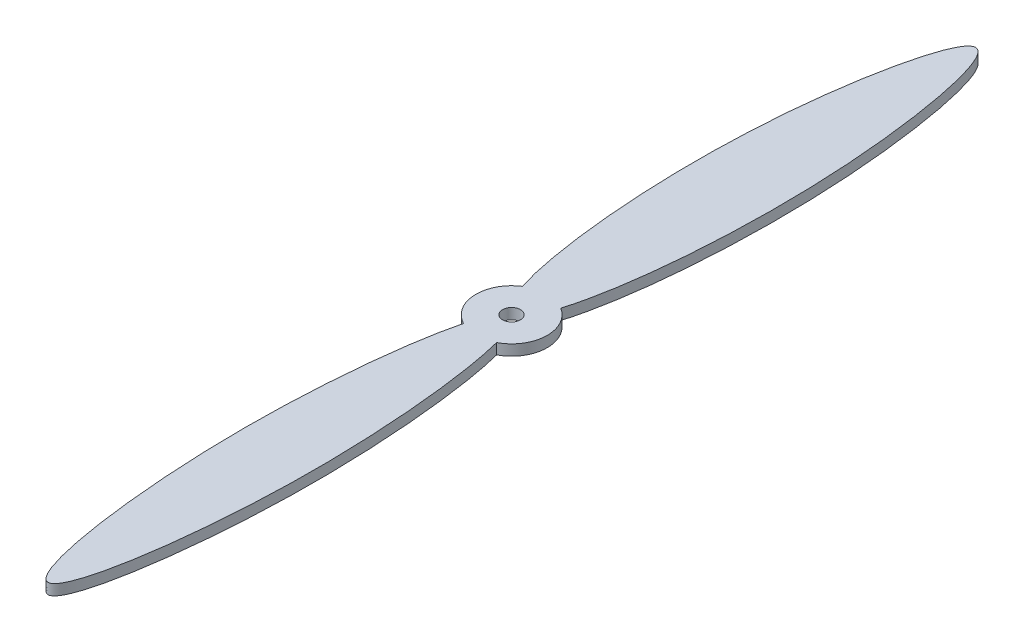
ISO-10303-21;
HEADER;
FILE_DESCRIPTION(('STEP AP214'),'2;1');
FILE_NAME('part.step','',(''),(''),'','','');
FILE_SCHEMA(('AUTOMOTIVE_DESIGN { 1 0 10303 214 1 1 1 1 }'));
ENDSEC;
DATA;
#1=APPLICATION_CONTEXT('core data for automotive mechanical design processes');
#2=APPLICATION_PROTOCOL_DEFINITION('international standard','automotive_design',2000,#1);
#3=PRODUCT_CONTEXT('',#1,'mechanical');
#4=PRODUCT('Part','Part','',(#3));
#5=PRODUCT_RELATED_PRODUCT_CATEGORY('part','',(#4));
#6=PRODUCT_DEFINITION_FORMATION('','',#4);
#7=PRODUCT_DEFINITION_CONTEXT('part definition',#1,'design');
#8=PRODUCT_DEFINITION('design','',#6,#7);
#9=PRODUCT_DEFINITION_SHAPE('','',#8);
#10=(LENGTH_UNIT() NAMED_UNIT(*) SI_UNIT(.MILLI.,.METRE.));
#11=(NAMED_UNIT(*) PLANE_ANGLE_UNIT() SI_UNIT($,.RADIAN.));
#12=(NAMED_UNIT(*) SI_UNIT($,.STERADIAN.) SOLID_ANGLE_UNIT());
#13=UNCERTAINTY_MEASURE_WITH_UNIT(LENGTH_MEASURE(1.E-05),#10,'distance_accuracy_value','');
#14=(GEOMETRIC_REPRESENTATION_CONTEXT(3) GLOBAL_UNCERTAINTY_ASSIGNED_CONTEXT((#13)) GLOBAL_UNIT_ASSIGNED_CONTEXT((#10,
#11,#12)) REPRESENTATION_CONTEXT('',''));
#15=CARTESIAN_POINT('',(0.,0.,0.));
#16=DIRECTION('',(0.,0.,1.));
#17=DIRECTION('',(1.,0.,0.));
#18=AXIS2_PLACEMENT_3D('',#15,#16,#17);
#19=CARTESIAN_POINT('',(-6.89143837344638,3.81,-10.6676181570325));
#20=CARTESIAN_POINT('',(-13.1417398849449,3.81,-30.5748311336386));
#21=CARTESIAN_POINT('',(-19.5876683306086,3.81,-99.8811316852433));
#22=CARTESIAN_POINT('',(0.626884386836154,3.81,-189.415109593272));
#23=CARTESIAN_POINT('',(18.6841581022421,3.81,-98.5004904287372));
#24=CARTESIAN_POINT('',(12.5538768642198,3.81,-30.066409487248));
#25=CARTESIAN_POINT('',(6.70611320297183,3.81,-10.7850844089501));
#26=B_SPLINE_CURVE_WITH_KNOTS('',3,(#19,#20,#21,#22,#23,#24,#25),.UNSPECIFIED.,.F.,.F.,(4,1,1,1,
4),(0.0904426455914181,0.354535083339851,0.50015165909911,0.657030323691159,0.910712035370018),.UNSPECIFIED.);
#27=DIRECTION('',(0.,-1.,0.));
#28=VECTOR('',#27,1.);
#29=SURFACE_OF_LINEAR_EXTRUSION('',#26,#28);
#30=CARTESIAN_POINT('',(-6.89143837344638,0.,-10.6676181570325));
#31=CARTESIAN_POINT('',(-13.1417398849449,0.,-30.5748311336386));
#32=CARTESIAN_POINT('',(-19.5876683306086,0.,-99.8811316852433));
#33=CARTESIAN_POINT('',(0.626884386836154,0.,-189.415109593272));
#34=CARTESIAN_POINT('',(18.6841581022421,0.,-98.5004904287372));
#35=CARTESIAN_POINT('',(12.5538768642198,0.,-30.066409487248));
#36=CARTESIAN_POINT('',(6.70611320297183,0.,-10.7850844089501));
#37=B_SPLINE_CURVE_WITH_KNOTS('',3,(#30,#31,#32,#33,#34,#35,#36),.UNSPECIFIED.,.F.,.F.,(4,1,1,1,
4),(0.0904426455914181,0.354535083339851,0.50015165909911,0.657030323691159,0.910712035370018),.UNSPECIFIED.);
#38=CARTESIAN_POINT('',(-6.89143837344641,0.,-10.6676181570325));
#39=VERTEX_POINT('',#38);
#40=CARTESIAN_POINT('',(6.70611320297197,0.,-10.7850844089503));
#41=VERTEX_POINT('',#40);
#42=EDGE_CURVE('E130',#39,#41,#37,.T.);
#43=ORIENTED_EDGE('',*,*,#42,.F.);
#44=DIRECTION('',(0.,-1.,0.));
#45=VECTOR('',#44,1.);
#46=CARTESIAN_POINT('',(-6.89143837344641,3.81,-10.6676181570325));
#47=LINE('',#46,#45);
#48=CARTESIAN_POINT('',(-6.89143837344641,3.81,-10.6676181570325));
#49=VERTEX_POINT('',#48);
#50=EDGE_CURVE('E11',#49,#39,#47,.T.);
#51=ORIENTED_EDGE('',*,*,#50,.F.);
#52=CARTESIAN_POINT('',(6.70611320297197,3.81,-10.7850844089503));
#53=VERTEX_POINT('',#52);
#54=EDGE_CURVE('E96',#49,#53,#26,.T.);
#55=ORIENTED_EDGE('',*,*,#54,.T.);
#56=DIRECTION('',(0.,-1.,0.));
#57=VECTOR('',#56,1.);
#58=CARTESIAN_POINT('',(6.70611320297197,3.81,-10.7850844089503));
#59=LINE('',#58,#57);
#60=EDGE_CURVE('E84',#53,#41,#59,.T.);
#61=ORIENTED_EDGE('',*,*,#60,.T.);
#62=EDGE_LOOP('',(#43,#51,#55,#61));
#63=FACE_BOUND('',#62,.T.);
#64=ADVANCED_FACE('F43',(#63),#29,.T.);
#65=CARTESIAN_POINT('',(2.65641720184579E-12,3.81,3.45194865936031E-11));
#66=DIRECTION('',(0.,-1.,0.));
#67=DIRECTION('',(0.,0.,-1.));
#68=AXIS2_PLACEMENT_3D('',#65,#66,#67);
#69=CYLINDRICAL_SURFACE('',#68,12.7000000000013);
#70=CARTESIAN_POINT('',(2.65641720184579E-12,0.,3.45194865936031E-11));
#71=DIRECTION('',(0.,1.,0.));
#72=DIRECTION('',(0.,0.,1.));
#73=AXIS2_PLACEMENT_3D('',#70,#71,#72);
#74=CIRCLE('',#73,12.7000000000013);
#75=CARTESIAN_POINT('',(-5.88391039034271,0.,11.2547589276357));
#76=VERTEX_POINT('',#75);
#77=EDGE_CURVE('E102',#39,#76,#74,.T.);
#78=ORIENTED_EDGE('',*,*,#77,.T.);
#79=DIRECTION('',(0.,-1.,0.));
#80=VECTOR('',#79,1.);
#81=CARTESIAN_POINT('',(-5.88391039034271,3.81,11.2547589276357));
#82=LINE('',#81,#80);
#83=CARTESIAN_POINT('',(-5.88391039034271,3.81,11.2547589276357));
#84=VERTEX_POINT('',#83);
#85=EDGE_CURVE('E53',#84,#76,#82,.T.);
#86=ORIENTED_EDGE('',*,*,#85,.F.);
#87=CARTESIAN_POINT('',(2.65641720184579E-12,3.81,3.45194865936031E-11));
#88=DIRECTION('',(0.,1.,0.));
#89=DIRECTION('',(0.,0.,1.));
#90=AXIS2_PLACEMENT_3D('',#87,#88,#89);
#91=CIRCLE('',#90,12.7000000000013);
#92=EDGE_CURVE('E90',#49,#84,#91,.T.);
#93=ORIENTED_EDGE('',*,*,#92,.F.);
#94=ORIENTED_EDGE('',*,*,#50,.T.);
#95=EDGE_LOOP('',(#78,#86,#93,#94));
#96=FACE_BOUND('',#95,.T.);
#97=ADVANCED_FACE('F100',(#96),#69,.T.);
#98=CARTESIAN_POINT('',(-5.88391039034274,3.81,11.2547589276358));
#99=CARTESIAN_POINT('',(-9.8664162392,3.81,26.6664881609986));
#100=CARTESIAN_POINT('',(-16.9944819806541,3.81,95.9292534775159));
#101=CARTESIAN_POINT('',(-0.0266324184096713,3.81,205.140276041775));
#102=CARTESIAN_POINT('',(16.9899674622603,3.81,96.014162194213));
#103=CARTESIAN_POINT('',(9.88781685528225,3.81,26.7053172479885));
#104=CARTESIAN_POINT('',(5.89538678400688,3.81,11.2487516937542));
#105=B_SPLINE_CURVE_WITH_KNOTS('',3,(#98,#99,#100,#101,#102,#103,#104),.UNSPECIFIED.,.F.,.F.,(4,
1,1,1,4),(0.0801285586013679,0.256247262210845,0.499498500002481,0.741948496984021,
0.918677055799129),.UNSPECIFIED.);
#106=DIRECTION('',(0.,-1.,0.));
#107=VECTOR('',#106,1.);
#108=SURFACE_OF_LINEAR_EXTRUSION('',#105,#107);
#109=CARTESIAN_POINT('',(-5.88391039034274,0.,11.2547589276358));
#110=CARTESIAN_POINT('',(-9.8664162392,0.,26.6664881609986));
#111=CARTESIAN_POINT('',(-16.9944819806541,0.,95.9292534775159));
#112=CARTESIAN_POINT('',(-0.0266324184096713,0.,205.140276041775));
#113=CARTESIAN_POINT('',(16.9899674622603,0.,96.014162194213));
#114=CARTESIAN_POINT('',(9.88781685528225,0.,26.7053172479885));
#115=CARTESIAN_POINT('',(5.89538678400688,0.,11.2487516937542));
#116=B_SPLINE_CURVE_WITH_KNOTS('',3,(#109,#110,#111,#112,#113,#114,#115),.UNSPECIFIED.,.F.,.F.,
(4,1,1,1,4),(0.0801285586013679,0.256247262210845,0.499498500002481,0.741948496984021,
0.918677055799129),.UNSPECIFIED.);
#117=CARTESIAN_POINT('',(5.89538678400676,0.,11.248751693754));
#118=VERTEX_POINT('',#117);
#119=EDGE_CURVE('E77',#76,#118,#116,.T.);
#120=ORIENTED_EDGE('',*,*,#119,.T.);
#121=DIRECTION('',(0.,-1.,0.));
#122=VECTOR('',#121,1.);
#123=CARTESIAN_POINT('',(5.89538678400676,3.81,11.248751693754));
#124=LINE('',#123,#122);
#125=CARTESIAN_POINT('',(5.89538678400676,3.81,11.248751693754));
#126=VERTEX_POINT('',#125);
#127=EDGE_CURVE('E104',#126,#118,#124,.T.);
#128=ORIENTED_EDGE('',*,*,#127,.F.);
#129=EDGE_CURVE('E95',#84,#126,#105,.T.);
#130=ORIENTED_EDGE('',*,*,#129,.F.);
#131=ORIENTED_EDGE('',*,*,#85,.T.);
#132=EDGE_LOOP('',(#120,#128,#130,#131));
#133=FACE_BOUND('',#132,.T.);
#134=ADVANCED_FACE('F105',(#133),#108,.F.);
#135=CARTESIAN_POINT('',(2.65641720184579E-12,3.81,3.45194865936031E-11));
#136=DIRECTION('',(0.,-1.,0.));
#137=DIRECTION('',(0.,0.,-1.));
#138=AXIS2_PLACEMENT_3D('',#135,#136,#137);
#139=CYLINDRICAL_SURFACE('',#138,12.6999999999987);
#140=CARTESIAN_POINT('',(2.65641720184579E-12,0.,3.45194865936031E-11));
#141=DIRECTION('',(0.,1.,0.));
#142=DIRECTION('',(0.,0.,1.));
#143=AXIS2_PLACEMENT_3D('',#140,#141,#142);
#144=CIRCLE('',#143,12.6999999999987);
#145=EDGE_CURVE('E147',#118,#41,#144,.T.);
#146=ORIENTED_EDGE('',*,*,#145,.T.);
#147=ORIENTED_EDGE('',*,*,#60,.F.);
#148=CARTESIAN_POINT('',(2.65641720184579E-12,3.81,3.45194865936031E-11));
#149=DIRECTION('',(0.,1.,0.));
#150=DIRECTION('',(0.,0.,1.));
#151=AXIS2_PLACEMENT_3D('',#148,#149,#150);
#152=CIRCLE('',#151,12.6999999999987);
#153=EDGE_CURVE('E61',#126,#53,#152,.T.);
#154=ORIENTED_EDGE('',*,*,#153,.F.);
#155=ORIENTED_EDGE('',*,*,#127,.T.);
#156=EDGE_LOOP('',(#146,#147,#154,#155));
#157=FACE_BOUND('',#156,.T.);
#158=ADVANCED_FACE('F121',(#157),#139,.T.);
#159=CARTESIAN_POINT('',(-0.037840034408479,3.81,0.000665163902023532));
#160=DIRECTION('',(0.,-1.,0.));
#161=DIRECTION('',(0.,0.,-1.));
#162=AXIS2_PLACEMENT_3D('',#159,#160,#161);
#163=CYLINDRICAL_SURFACE('',#162,3.175);
#164=CARTESIAN_POINT('',(-0.037840034408479,3.81,0.000665163902023532));
#165=DIRECTION('',(0.,1.,0.));
#166=DIRECTION('',(0.,0.,1.));
#167=AXIS2_PLACEMENT_3D('',#164,#165,#166);
#168=CIRCLE('',#167,3.175);
#169=CARTESIAN_POINT('',(-0.037840034408479,3.81,3.17566516390202));
#170=VERTEX_POINT('',#169);
#171=EDGE_CURVE('E109',#170,#170,#168,.T.);
#172=ORIENTED_EDGE('',*,*,#171,.T.);
#173=EDGE_LOOP('',(#172));
#174=FACE_BOUND('',#173,.T.);
#175=CARTESIAN_POINT('',(-0.037840034408479,0.,0.000665163902023532));
#176=DIRECTION('',(0.,1.,0.));
#177=DIRECTION('',(0.,0.,1.));
#178=AXIS2_PLACEMENT_3D('',#175,#176,#177);
#179=CIRCLE('',#178,3.175);
#180=CARTESIAN_POINT('',(-0.037840034408479,0.,3.17566516390202));
#181=VERTEX_POINT('',#180);
#182=EDGE_CURVE('E153',#181,#181,#179,.T.);
#183=ORIENTED_EDGE('',*,*,#182,.F.);
#184=EDGE_LOOP('',(#183));
#185=FACE_BOUND('',#184,.T.);
#186=ADVANCED_FACE('F167',(#174,#185),#163,.F.);
#187=CARTESIAN_POINT('',(0.,3.81,0.));
#188=DIRECTION('',(0.,1.,0.));
#189=DIRECTION('',(0.,0.,1.));
#190=AXIS2_PLACEMENT_3D('',#187,#188,#189);
#191=PLANE('',#190);
#192=ORIENTED_EDGE('',*,*,#54,.F.);
#193=ORIENTED_EDGE('',*,*,#92,.T.);
#194=ORIENTED_EDGE('',*,*,#129,.T.);
#195=ORIENTED_EDGE('',*,*,#153,.T.);
#196=EDGE_LOOP('',(#192,#193,#194,#195));
#197=FACE_BOUND('',#196,.T.);
#198=ORIENTED_EDGE('',*,*,#171,.F.);
#199=EDGE_LOOP('',(#198));
#200=FACE_BOUND('',#199,.T.);
#201=ADVANCED_FACE('F92',(#197,#200),#191,.T.);
#202=CARTESIAN_POINT('',(0.,0.,0.));
#203=DIRECTION('',(0.,1.,0.));
#204=DIRECTION('',(0.,0.,1.));
#205=AXIS2_PLACEMENT_3D('',#202,#203,#204);
#206=PLANE('',#205);
#207=ORIENTED_EDGE('',*,*,#42,.T.);
#208=ORIENTED_EDGE('',*,*,#145,.F.);
#209=ORIENTED_EDGE('',*,*,#119,.F.);
#210=ORIENTED_EDGE('',*,*,#77,.F.);
#211=EDGE_LOOP('',(#207,#208,#209,#210));
#212=FACE_BOUND('',#211,.T.);
#213=ORIENTED_EDGE('',*,*,#182,.T.);
#214=EDGE_LOOP('',(#213));
#215=FACE_BOUND('',#214,.T.);
#216=ADVANCED_FACE('F161',(#212,#215),#206,.F.);
#217=CLOSED_SHELL('',(#64,#97,#134,#158,#186,#201,#216));
#218=MANIFOLD_SOLID_BREP('B2',#217);
#219=ADVANCED_BREP_SHAPE_REPRESENTATION('',(#18,#218),#14);
#220=SHAPE_DEFINITION_REPRESENTATION(#9,#219);
ENDSEC;
END-ISO-10303-21;
